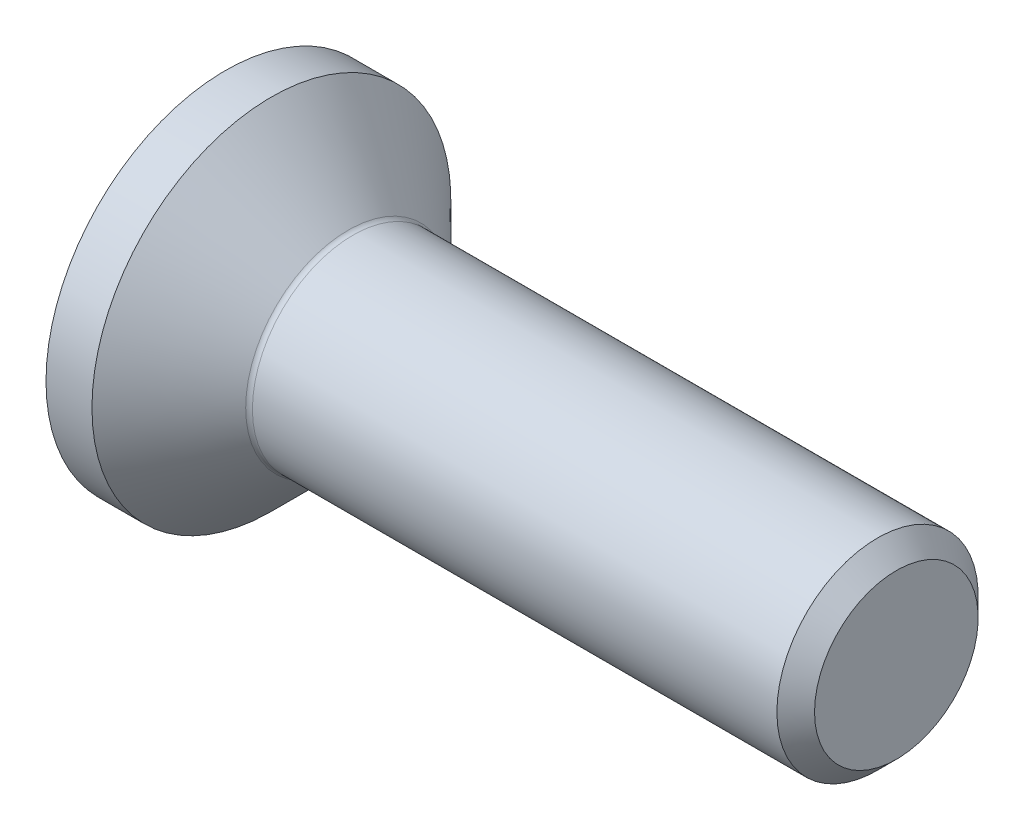
ISO-10303-21;
HEADER;
FILE_DESCRIPTION(('STEP AP214'),'2;1');
FILE_NAME('part.step','',(''),(''),'','','');
FILE_SCHEMA(('AUTOMOTIVE_DESIGN { 1 0 10303 214 1 1 1 1 }'));
ENDSEC;
DATA;
#1=APPLICATION_CONTEXT('core data for automotive mechanical design processes');
#2=APPLICATION_PROTOCOL_DEFINITION('international standard','automotive_design',2000,#1);
#3=PRODUCT_CONTEXT('',#1,'mechanical');
#4=PRODUCT('Part','Part','',(#3));
#5=PRODUCT_RELATED_PRODUCT_CATEGORY('part','',(#4));
#6=PRODUCT_DEFINITION_FORMATION('','',#4);
#7=PRODUCT_DEFINITION_CONTEXT('part definition',#1,'design');
#8=PRODUCT_DEFINITION('design','',#6,#7);
#9=PRODUCT_DEFINITION_SHAPE('','',#8);
#10=(LENGTH_UNIT() NAMED_UNIT(*) SI_UNIT(.MILLI.,.METRE.));
#11=(NAMED_UNIT(*) PLANE_ANGLE_UNIT() SI_UNIT($,.RADIAN.));
#12=(NAMED_UNIT(*) SI_UNIT($,.STERADIAN.) SOLID_ANGLE_UNIT());
#13=UNCERTAINTY_MEASURE_WITH_UNIT(LENGTH_MEASURE(1.E-05),#10,'distance_accuracy_value','');
#14=(GEOMETRIC_REPRESENTATION_CONTEXT(3) GLOBAL_UNCERTAINTY_ASSIGNED_CONTEXT((#13)) GLOBAL_UNIT_ASSIGNED_CONTEXT((#10,
#11,#12)) REPRESENTATION_CONTEXT('',''));
#15=CARTESIAN_POINT('',(0.,0.,0.));
#16=DIRECTION('',(0.,0.,1.));
#17=DIRECTION('',(1.,0.,0.));
#18=AXIS2_PLACEMENT_3D('',#15,#16,#17);
#19=CARTESIAN_POINT('',(0.,0.,0.));
#20=DIRECTION('',(-1.,0.,0.));
#21=DIRECTION('',(0.,0.,1.));
#22=AXIS2_PLACEMENT_3D('',#19,#20,#21);
#23=PLANE('',#22);
#24=CARTESIAN_POINT('',(0.,0.,0.));
#25=DIRECTION('',(-1.,0.,0.));
#26=DIRECTION('',(0.,0.,1.));
#27=AXIS2_PLACEMENT_3D('',#24,#25,#26);
#28=CIRCLE('',#27,2.675);
#29=CARTESIAN_POINT('',(0.,0.,2.675));
#30=VERTEX_POINT('',#29);
#31=EDGE_CURVE('E153',#30,#30,#28,.T.);
#32=ORIENTED_EDGE('',*,*,#31,.T.);
#33=EDGE_LOOP('',(#32));
#34=FACE_BOUND('',#33,.T.);
#35=DIRECTION('',(0.,-0.499999999999998,-0.86602540378444));
#36=VECTOR('',#35,1.);
#37=CARTESIAN_POINT('',(0.,-0.577350269189626,1.));
#38=LINE('',#37,#36);
#39=CARTESIAN_POINT('',(0.,-0.577350269189626,1.));
#40=VERTEX_POINT('',#39);
#41=CARTESIAN_POINT('',(0.,-1.15470053837925,0.));
#42=VERTEX_POINT('',#41);
#43=EDGE_CURVE('E119',#40,#42,#38,.T.);
#44=ORIENTED_EDGE('',*,*,#43,.T.);
#45=DIRECTION('',(0.,0.499999999999999,-0.866025403784439));
#46=VECTOR('',#45,1.);
#47=CARTESIAN_POINT('',(0.,-1.15470053837925,0.));
#48=LINE('',#47,#46);
#49=CARTESIAN_POINT('',(0.,-0.577350269189625,-1.));
#50=VERTEX_POINT('',#49);
#51=EDGE_CURVE('E50',#42,#50,#48,.T.);
#52=ORIENTED_EDGE('',*,*,#51,.T.);
#53=DIRECTION('',(0.,1.,0.));
#54=VECTOR('',#53,1.);
#55=CARTESIAN_POINT('',(0.,-0.577350269189625,-1.));
#56=LINE('',#55,#54);
#57=CARTESIAN_POINT('',(0.,0.577350269189626,-1.));
#58=VERTEX_POINT('',#57);
#59=EDGE_CURVE('E130',#50,#58,#56,.T.);
#60=ORIENTED_EDGE('',*,*,#59,.T.);
#61=DIRECTION('',(0.,0.5,0.866025403784439));
#62=VECTOR('',#61,1.);
#63=CARTESIAN_POINT('',(0.,0.577350269189626,-1.));
#64=LINE('',#63,#62);
#65=CARTESIAN_POINT('',(0.,1.15470053837925,0.));
#66=VERTEX_POINT('',#65);
#67=EDGE_CURVE('E254',#58,#66,#64,.T.);
#68=ORIENTED_EDGE('',*,*,#67,.T.);
#69=DIRECTION('',(0.,-0.499999999999999,0.866025403784439));
#70=VECTOR('',#69,1.);
#71=CARTESIAN_POINT('',(0.,1.15470053837925,0.));
#72=LINE('',#71,#70);
#73=CARTESIAN_POINT('',(0.,0.577350269189625,0.999999999999999));
#74=VERTEX_POINT('',#73);
#75=EDGE_CURVE('E257',#66,#74,#72,.T.);
#76=ORIENTED_EDGE('',*,*,#75,.T.);
#77=DIRECTION('',(0.,-1.,0.));
#78=VECTOR('',#77,1.);
#79=CARTESIAN_POINT('',(0.,0.577350269189625,0.999999999999999));
#80=LINE('',#79,#78);
#81=EDGE_CURVE('E260',#74,#40,#80,.T.);
#82=ORIENTED_EDGE('',*,*,#81,.T.);
#83=EDGE_LOOP('',(#44,#52,#60,#68,#76,#82));
#84=FACE_BOUND('',#83,.T.);
#85=ADVANCED_FACE('F35',(#34,#84),#23,.T.);
#86=CARTESIAN_POINT('',(0.,0.,0.));
#87=DIRECTION('',(-1.,0.,0.));
#88=DIRECTION('',(0.,0.,1.));
#89=AXIS2_PLACEMENT_3D('',#86,#87,#88);
#90=CYLINDRICAL_SURFACE('',#89,2.675);
#91=CARTESIAN_POINT('',(0.685000000000012,0.,0.));
#92=DIRECTION('',(-1.,0.,0.));
#93=DIRECTION('',(0.,0.,1.));
#94=AXIS2_PLACEMENT_3D('',#91,#92,#93);
#95=CIRCLE('',#94,2.675);
#96=CARTESIAN_POINT('',(0.685000000000012,0.,2.675));
#97=VERTEX_POINT('',#96);
#98=EDGE_CURVE('E150',#97,#97,#95,.T.);
#99=ORIENTED_EDGE('',*,*,#98,.T.);
#100=EDGE_LOOP('',(#99));
#101=FACE_BOUND('',#100,.T.);
#102=ORIENTED_EDGE('',*,*,#31,.F.);
#103=EDGE_LOOP('',(#102));
#104=FACE_BOUND('',#103,.T.);
#105=ADVANCED_FACE('F174',(#101,#104),#90,.T.);
#106=CARTESIAN_POINT('',(0.685000000000012,0.,0.));
#107=DIRECTION('',(-1.,0.,0.));
#108=DIRECTION('',(0.,0.,1.));
#109=AXIS2_PLACEMENT_3D('',#106,#107,#108);
#110=CONICAL_SURFACE('',#109,2.675,0.785398163397451);
#111=CARTESIAN_POINT('',(1.83071067811866,0.,0.));
#112=DIRECTION('',(-1.,0.,0.));
#113=DIRECTION('',(0.,0.,1.));
#114=AXIS2_PLACEMENT_3D('',#111,#112,#113);
#115=CIRCLE('',#114,1.52928932188135);
#116=CARTESIAN_POINT('',(1.83071067811866,0.,1.52928932188135));
#117=VERTEX_POINT('',#116);
#118=EDGE_CURVE('E43',#117,#117,#115,.T.);
#119=ORIENTED_EDGE('',*,*,#118,.T.);
#120=EDGE_LOOP('',(#119));
#121=FACE_BOUND('',#120,.T.);
#122=ORIENTED_EDGE('',*,*,#98,.F.);
#123=EDGE_LOOP('',(#122));
#124=FACE_BOUND('',#123,.T.);
#125=ADVANCED_FACE('F158',(#121,#124),#110,.T.);
#126=CARTESIAN_POINT('',(0.,0.,0.));
#127=DIRECTION('',(-1.,0.,0.));
#128=DIRECTION('',(0.,0.,1.));
#129=AXIS2_PLACEMENT_3D('',#126,#127,#128);
#130=CYLINDRICAL_SURFACE('',#129,1.5);
#131=CARTESIAN_POINT('',(1.90142135623731,0.,0.));
#132=DIRECTION('',(-1.,0.,0.));
#133=DIRECTION('',(0.,0.,1.));
#134=AXIS2_PLACEMENT_3D('',#131,#132,#133);
#135=CIRCLE('',#134,1.5);
#136=CARTESIAN_POINT('',(1.90142135623731,0.,1.5));
#137=VERTEX_POINT('',#136);
#138=EDGE_CURVE('E11',#137,#137,#135,.F.);
#139=ORIENTED_EDGE('',*,*,#138,.T.);
#140=EDGE_LOOP('',(#139));
#141=FACE_BOUND('',#140,.T.);
#142=CARTESIAN_POINT('',(9.71949999999999,0.,0.));
#143=DIRECTION('',(-1.,0.,0.));
#144=DIRECTION('',(0.,0.,1.));
#145=AXIS2_PLACEMENT_3D('',#142,#143,#144);
#146=CIRCLE('',#145,1.5);
#147=CARTESIAN_POINT('',(9.71949999999999,0.,1.5));
#148=VERTEX_POINT('',#147);
#149=EDGE_CURVE('E147',#148,#148,#146,.T.);
#150=ORIENTED_EDGE('',*,*,#149,.T.);
#151=EDGE_LOOP('',(#150));
#152=FACE_BOUND('',#151,.T.);
#153=ADVANCED_FACE('F185',(#141,#152),#130,.T.);
#154=CARTESIAN_POINT('',(9.99999999999999,0.,0.));
#155=DIRECTION('',(-1.,0.,0.));
#156=DIRECTION('',(0.,0.,1.));
#157=AXIS2_PLACEMENT_3D('',#154,#155,#156);
#158=CONICAL_SURFACE('',#157,1.2195,0.785398163397448);
#159=ORIENTED_EDGE('',*,*,#149,.F.);
#160=EDGE_LOOP('',(#159));
#161=FACE_BOUND('',#160,.T.);
#162=CARTESIAN_POINT('',(9.99999999999999,0.,0.));
#163=DIRECTION('',(-1.,0.,0.));
#164=DIRECTION('',(0.,0.,1.));
#165=AXIS2_PLACEMENT_3D('',#162,#163,#164);
#166=CIRCLE('',#165,1.2195);
#167=CARTESIAN_POINT('',(9.99999999999999,0.,1.2195));
#168=VERTEX_POINT('',#167);
#169=EDGE_CURVE('E143',#168,#168,#166,.T.);
#170=ORIENTED_EDGE('',*,*,#169,.T.);
#171=EDGE_LOOP('',(#170));
#172=FACE_BOUND('',#171,.T.);
#173=ADVANCED_FACE('F169',(#161,#172),#158,.T.);
#174=CARTESIAN_POINT('',(9.99999999999999,1.2195,0.));
#175=DIRECTION('',(1.,0.,0.));
#176=DIRECTION('',(0.,0.,-1.));
#177=AXIS2_PLACEMENT_3D('',#174,#175,#176);
#178=PLANE('',#177);
#179=ORIENTED_EDGE('',*,*,#169,.F.);
#180=EDGE_LOOP('',(#179));
#181=FACE_BOUND('',#180,.T.);
#182=ADVANCED_FACE('F162',(#181),#178,.T.);
#183=CARTESIAN_POINT('',(1.90142135623731,0.,0.));
#184=DIRECTION('',(-1.,0.,0.));
#185=DIRECTION('',(0.,0.,1.));
#186=AXIS2_PLACEMENT_3D('',#183,#184,#185);
#187=TOROIDAL_SURFACE('',#186,1.6,0.1);
#188=ORIENTED_EDGE('',*,*,#138,.F.);
#189=EDGE_LOOP('',(#188));
#190=FACE_BOUND('',#189,.T.);
#191=ORIENTED_EDGE('',*,*,#118,.F.);
#192=EDGE_LOOP('',(#191));
#193=FACE_BOUND('',#192,.T.);
#194=ADVANCED_FACE('F37',(#190,#193),#187,.F.);
#195=CARTESIAN_POINT('',(1.1,-1.15470053837925,0.));
#196=DIRECTION('',(0.,0.866025403784439,0.499999999999999));
#197=DIRECTION('',(0.,-0.499999999999999,0.866025403784439));
#198=AXIS2_PLACEMENT_3D('',#195,#196,#197);
#199=PLANE('',#198);
#200=ORIENTED_EDGE('',*,*,#51,.F.);
#201=DIRECTION('',(-1.,0.,0.));
#202=VECTOR('',#201,1.);
#203=CARTESIAN_POINT('',(1.1,-1.15470053837925,0.));
#204=LINE('',#203,#202);
#205=CARTESIAN_POINT('',(1.1,-1.15470053837925,0.));
#206=VERTEX_POINT('',#205);
#207=EDGE_CURVE('E251',#206,#42,#204,.T.);
#208=ORIENTED_EDGE('',*,*,#207,.F.);
#209=DIRECTION('',(0.,0.499999999999999,-0.866025403784439));
#210=VECTOR('',#209,1.);
#211=CARTESIAN_POINT('',(1.1,-1.15470053837925,0.));
#212=LINE('',#211,#210);
#213=CARTESIAN_POINT('',(1.1,-0.866025403784438,-0.499999999999998));
#214=VERTEX_POINT('',#213);
#215=EDGE_CURVE('E115',#206,#214,#212,.T.);
#216=ORIENTED_EDGE('',*,*,#215,.T.);
#217=CARTESIAN_POINT('',(1.1,-0.577350269189625,-1.));
#218=VERTEX_POINT('',#217);
#219=EDGE_CURVE('E111',#214,#218,#212,.T.);
#220=ORIENTED_EDGE('',*,*,#219,.T.);
#221=DIRECTION('',(-1.,0.,0.));
#222=VECTOR('',#221,1.);
#223=CARTESIAN_POINT('',(1.1,-0.577350269189625,-1.));
#224=LINE('',#223,#222);
#225=EDGE_CURVE('E113',#218,#50,#224,.T.);
#226=ORIENTED_EDGE('',*,*,#225,.T.);
#227=EDGE_LOOP('',(#200,#208,#216,#220,#226));
#228=FACE_BOUND('',#227,.T.);
#229=ADVANCED_FACE('F112',(#228),#199,.T.);
#230=CARTESIAN_POINT('',(1.1,-0.577350269189625,-1.));
#231=DIRECTION('',(0.,0.,1.));
#232=DIRECTION('',(1.,0.,0.));
#233=AXIS2_PLACEMENT_3D('',#230,#231,#232);
#234=PLANE('',#233);
#235=ORIENTED_EDGE('',*,*,#59,.F.);
#236=ORIENTED_EDGE('',*,*,#225,.F.);
#237=DIRECTION('',(0.,1.,0.));
#238=VECTOR('',#237,1.);
#239=CARTESIAN_POINT('',(1.1,-0.577350269189625,-1.));
#240=LINE('',#239,#238);
#241=CARTESIAN_POINT('',(1.1,0.,-1.));
#242=VERTEX_POINT('',#241);
#243=EDGE_CURVE('E58',#218,#242,#240,.T.);
#244=ORIENTED_EDGE('',*,*,#243,.T.);
#245=CARTESIAN_POINT('',(1.1,0.577350269189626,-1.));
#246=VERTEX_POINT('',#245);
#247=EDGE_CURVE('E125',#242,#246,#240,.T.);
#248=ORIENTED_EDGE('',*,*,#247,.T.);
#249=DIRECTION('',(-1.,0.,0.));
#250=VECTOR('',#249,1.);
#251=CARTESIAN_POINT('',(1.1,0.577350269189626,-1.));
#252=LINE('',#251,#250);
#253=EDGE_CURVE('E132',#246,#58,#252,.T.);
#254=ORIENTED_EDGE('',*,*,#253,.T.);
#255=EDGE_LOOP('',(#235,#236,#244,#248,#254));
#256=FACE_BOUND('',#255,.T.);
#257=ADVANCED_FACE('F127',(#256),#234,.T.);
#258=CARTESIAN_POINT('',(1.1,0.577350269189626,-1.));
#259=DIRECTION('',(0.,-0.866025403784438,0.5));
#260=DIRECTION('',(0.,-0.5,-0.866025403784439));
#261=AXIS2_PLACEMENT_3D('',#258,#259,#260);
#262=PLANE('',#261);
#263=ORIENTED_EDGE('',*,*,#67,.F.);
#264=ORIENTED_EDGE('',*,*,#253,.F.);
#265=DIRECTION('',(0.,0.5,0.866025403784439));
#266=VECTOR('',#265,1.);
#267=CARTESIAN_POINT('',(1.1,0.577350269189626,-1.));
#268=LINE('',#267,#266);
#269=CARTESIAN_POINT('',(1.1,0.866025403784439,-0.5));
#270=VERTEX_POINT('',#269);
#271=EDGE_CURVE('E232',#246,#270,#268,.T.);
#272=ORIENTED_EDGE('',*,*,#271,.T.);
#273=CARTESIAN_POINT('',(1.1,1.15470053837925,0.));
#274=VERTEX_POINT('',#273);
#275=EDGE_CURVE('E124',#270,#274,#268,.T.);
#276=ORIENTED_EDGE('',*,*,#275,.T.);
#277=DIRECTION('',(-1.,0.,0.));
#278=VECTOR('',#277,1.);
#279=CARTESIAN_POINT('',(1.1,1.15470053837925,0.));
#280=LINE('',#279,#278);
#281=EDGE_CURVE('E138',#274,#66,#280,.T.);
#282=ORIENTED_EDGE('',*,*,#281,.T.);
#283=EDGE_LOOP('',(#263,#264,#272,#276,#282));
#284=FACE_BOUND('',#283,.T.);
#285=ADVANCED_FACE('F199',(#284),#262,.T.);
#286=CARTESIAN_POINT('',(1.1,1.15470053837925,0.));
#287=DIRECTION('',(0.,-0.866025403784439,-0.499999999999999));
#288=DIRECTION('',(0.,0.499999999999999,-0.866025403784439));
#289=AXIS2_PLACEMENT_3D('',#286,#287,#288);
#290=PLANE('',#289);
#291=ORIENTED_EDGE('',*,*,#75,.F.);
#292=ORIENTED_EDGE('',*,*,#281,.F.);
#293=DIRECTION('',(0.,-0.499999999999999,0.866025403784439));
#294=VECTOR('',#293,1.);
#295=CARTESIAN_POINT('',(1.1,1.15470053837925,0.));
#296=LINE('',#295,#294);
#297=CARTESIAN_POINT('',(1.1,0.866025403784438,0.499999999999999));
#298=VERTEX_POINT('',#297);
#299=EDGE_CURVE('E239',#274,#298,#296,.T.);
#300=ORIENTED_EDGE('',*,*,#299,.T.);
#301=CARTESIAN_POINT('',(1.1,0.577350269189625,0.999999999999999));
#302=VERTEX_POINT('',#301);
#303=EDGE_CURVE('E237',#298,#302,#296,.T.);
#304=ORIENTED_EDGE('',*,*,#303,.T.);
#305=DIRECTION('',(-1.,0.,0.));
#306=VECTOR('',#305,1.);
#307=CARTESIAN_POINT('',(1.1,0.577350269189625,0.999999999999999));
#308=LINE('',#307,#306);
#309=EDGE_CURVE('E269',#302,#74,#308,.T.);
#310=ORIENTED_EDGE('',*,*,#309,.T.);
#311=EDGE_LOOP('',(#291,#292,#300,#304,#310));
#312=FACE_BOUND('',#311,.T.);
#313=ADVANCED_FACE('F202',(#312),#290,.T.);
#314=CARTESIAN_POINT('',(1.1,0.577350269189625,0.999999999999999));
#315=DIRECTION('',(0.,0.,-1.));
#316=DIRECTION('',(0.,1.,0.));
#317=AXIS2_PLACEMENT_3D('',#314,#315,#316);
#318=PLANE('',#317);
#319=ORIENTED_EDGE('',*,*,#81,.F.);
#320=ORIENTED_EDGE('',*,*,#309,.F.);
#321=DIRECTION('',(0.,-1.,0.));
#322=VECTOR('',#321,1.);
#323=CARTESIAN_POINT('',(1.1,0.577350269189625,0.999999999999999));
#324=LINE('',#323,#322);
#325=CARTESIAN_POINT('',(1.1,0.,1.));
#326=VERTEX_POINT('',#325);
#327=EDGE_CURVE('E244',#302,#326,#324,.T.);
#328=ORIENTED_EDGE('',*,*,#327,.T.);
#329=CARTESIAN_POINT('',(1.1,-0.577350269189626,1.));
#330=VERTEX_POINT('',#329);
#331=EDGE_CURVE('E243',#326,#330,#324,.T.);
#332=ORIENTED_EDGE('',*,*,#331,.T.);
#333=DIRECTION('',(-1.,0.,0.));
#334=VECTOR('',#333,1.);
#335=CARTESIAN_POINT('',(1.1,-0.577350269189626,1.));
#336=LINE('',#335,#334);
#337=EDGE_CURVE('E266',#330,#40,#336,.T.);
#338=ORIENTED_EDGE('',*,*,#337,.T.);
#339=EDGE_LOOP('',(#319,#320,#328,#332,#338));
#340=FACE_BOUND('',#339,.T.);
#341=ADVANCED_FACE('F206',(#340),#318,.T.);
#342=CARTESIAN_POINT('',(1.1,-0.577350269189626,1.));
#343=DIRECTION('',(0.,0.86602540378444,-0.499999999999998));
#344=DIRECTION('',(0.,0.499999999999998,0.86602540378444));
#345=AXIS2_PLACEMENT_3D('',#342,#343,#344);
#346=PLANE('',#345);
#347=ORIENTED_EDGE('',*,*,#43,.F.);
#348=ORIENTED_EDGE('',*,*,#337,.F.);
#349=DIRECTION('',(0.,-0.499999999999998,-0.86602540378444));
#350=VECTOR('',#349,1.);
#351=CARTESIAN_POINT('',(1.1,-0.577350269189626,1.));
#352=LINE('',#351,#350);
#353=CARTESIAN_POINT('',(1.1,-0.866025403784439,0.499999999999997));
#354=VERTEX_POINT('',#353);
#355=EDGE_CURVE('E248',#330,#354,#352,.T.);
#356=ORIENTED_EDGE('',*,*,#355,.T.);
#357=EDGE_CURVE('E247',#354,#206,#352,.T.);
#358=ORIENTED_EDGE('',*,*,#357,.T.);
#359=ORIENTED_EDGE('',*,*,#207,.T.);
#360=EDGE_LOOP('',(#347,#348,#356,#358,#359));
#361=FACE_BOUND('',#360,.T.);
#362=ADVANCED_FACE('F210',(#361),#346,.T.);
#363=CARTESIAN_POINT('',(1.1,-0.577350269189626,-1.));
#364=DIRECTION('',(1.,0.,0.));
#365=DIRECTION('',(0.,0.,-1.));
#366=AXIS2_PLACEMENT_3D('',#363,#364,#365);
#367=PLANE('',#366);
#368=ORIENTED_EDGE('',*,*,#243,.F.);
#369=ORIENTED_EDGE('',*,*,#219,.F.);
#370=CARTESIAN_POINT('',(1.1,0.,0.));
#371=DIRECTION('',(-1.,0.,0.));
#372=DIRECTION('',(0.,0.,1.));
#373=AXIS2_PLACEMENT_3D('',#370,#371,#372);
#374=CIRCLE('',#373,1.);
#375=EDGE_CURVE('E122',#242,#214,#374,.T.);
#376=ORIENTED_EDGE('',*,*,#375,.F.);
#377=EDGE_LOOP('',(#368,#369,#376));
#378=FACE_BOUND('',#377,.T.);
#379=ADVANCED_FACE('F121',(#378),#367,.F.);
#380=ORIENTED_EDGE('',*,*,#215,.F.);
#381=ORIENTED_EDGE('',*,*,#357,.F.);
#382=EDGE_CURVE('E135',#214,#354,#374,.T.);
#383=ORIENTED_EDGE('',*,*,#382,.F.);
#384=EDGE_LOOP('',(#380,#381,#383));
#385=FACE_BOUND('',#384,.T.);
#386=ADVANCED_FACE('F216',(#385),#367,.F.);
#387=ORIENTED_EDGE('',*,*,#355,.F.);
#388=ORIENTED_EDGE('',*,*,#331,.F.);
#389=EDGE_CURVE('E131',#354,#326,#374,.T.);
#390=ORIENTED_EDGE('',*,*,#389,.F.);
#391=EDGE_LOOP('',(#387,#388,#390));
#392=FACE_BOUND('',#391,.T.);
#393=ADVANCED_FACE('F220',(#392),#367,.F.);
#394=ORIENTED_EDGE('',*,*,#327,.F.);
#395=ORIENTED_EDGE('',*,*,#303,.F.);
#396=EDGE_CURVE('E137',#326,#298,#374,.T.);
#397=ORIENTED_EDGE('',*,*,#396,.F.);
#398=EDGE_LOOP('',(#394,#395,#397));
#399=FACE_BOUND('',#398,.T.);
#400=ADVANCED_FACE('F228',(#399),#367,.F.);
#401=ORIENTED_EDGE('',*,*,#299,.F.);
#402=ORIENTED_EDGE('',*,*,#275,.F.);
#403=EDGE_CURVE('E144',#298,#270,#374,.T.);
#404=ORIENTED_EDGE('',*,*,#403,.F.);
#405=EDGE_LOOP('',(#401,#402,#404));
#406=FACE_BOUND('',#405,.T.);
#407=ADVANCED_FACE('F223',(#406),#367,.F.);
#408=ORIENTED_EDGE('',*,*,#271,.F.);
#409=ORIENTED_EDGE('',*,*,#247,.F.);
#410=EDGE_CURVE('E233',#270,#242,#374,.T.);
#411=ORIENTED_EDGE('',*,*,#410,.F.);
#412=EDGE_LOOP('',(#408,#409,#411));
#413=FACE_BOUND('',#412,.T.);
#414=ADVANCED_FACE('F194',(#413),#367,.F.);
#415=CARTESIAN_POINT('',(1.1,0.,0.));
#416=DIRECTION('',(-1.,0.,0.));
#417=DIRECTION('',(0.,0.,1.));
#418=AXIS2_PLACEMENT_3D('',#415,#416,#417);
#419=CONICAL_SURFACE('',#418,1.,1.04719755119659);
#420=CARTESIAN_POINT('',(1.67735026918963,0.,0.));
#421=VERTEX_POINT('',#420);
#422=VERTEX_LOOP('',#421);
#423=FACE_BOUND('',#422,.T.);
#424=ORIENTED_EDGE('',*,*,#396,.T.);
#425=ORIENTED_EDGE('',*,*,#403,.T.);
#426=ORIENTED_EDGE('',*,*,#410,.T.);
#427=ORIENTED_EDGE('',*,*,#375,.T.);
#428=ORIENTED_EDGE('',*,*,#382,.T.);
#429=ORIENTED_EDGE('',*,*,#389,.T.);
#430=EDGE_LOOP('',(#424,#425,#426,#427,#428,#429));
#431=FACE_BOUND('',#430,.T.);
#432=ADVANCED_FACE('F192',(#423,#431),#419,.F.);
#433=CLOSED_SHELL('',(#85,#105,#125,#153,#173,#182,#194,#229,#257,#285,#313,#341,#362,#379,#386,
#393,#400,#407,#414,#432));
#434=MANIFOLD_SOLID_BREP('B2',#433);
#435=ADVANCED_BREP_SHAPE_REPRESENTATION('',(#18,#434),#14);
#436=SHAPE_DEFINITION_REPRESENTATION(#9,#435);
ENDSEC;
END-ISO-10303-21;
